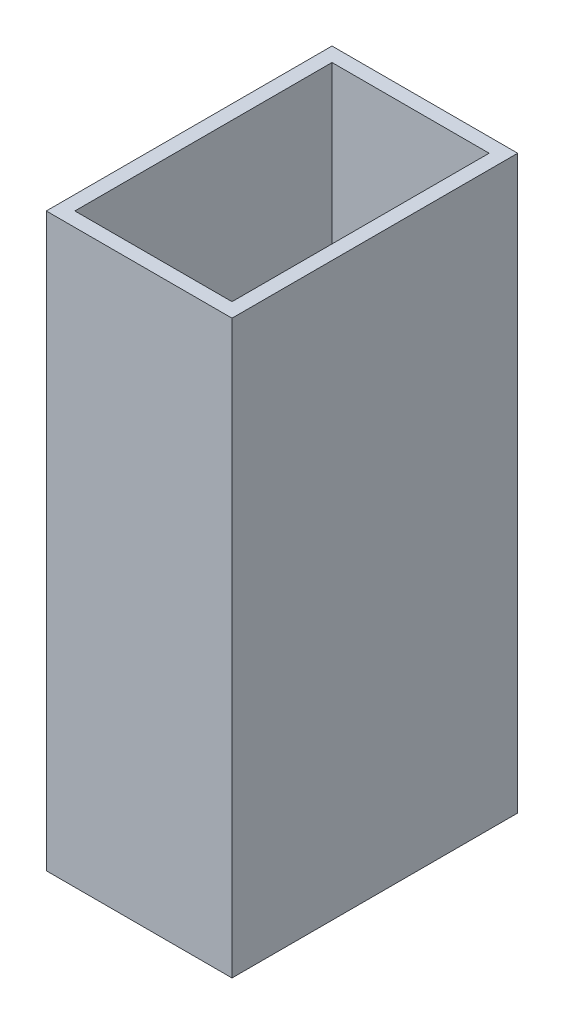
ISO-10303-21;
HEADER;
FILE_DESCRIPTION(('STEP AP214'),'2;1');
FILE_NAME('part.step','',(''),(''),'','','');
FILE_SCHEMA(('AUTOMOTIVE_DESIGN { 1 0 10303 214 1 1 1 1 }'));
ENDSEC;
DATA;
#1=APPLICATION_CONTEXT('core data for automotive mechanical design processes');
#2=APPLICATION_PROTOCOL_DEFINITION('international standard','automotive_design',2000,#1);
#3=PRODUCT_CONTEXT('',#1,'mechanical');
#4=PRODUCT('Part','Part','',(#3));
#5=PRODUCT_RELATED_PRODUCT_CATEGORY('part','',(#4));
#6=PRODUCT_DEFINITION_FORMATION('','',#4);
#7=PRODUCT_DEFINITION_CONTEXT('part definition',#1,'design');
#8=PRODUCT_DEFINITION('design','',#6,#7);
#9=PRODUCT_DEFINITION_SHAPE('','',#8);
#10=(LENGTH_UNIT() NAMED_UNIT(*) SI_UNIT(.MILLI.,.METRE.));
#11=(NAMED_UNIT(*) PLANE_ANGLE_UNIT() SI_UNIT($,.RADIAN.));
#12=(NAMED_UNIT(*) SI_UNIT($,.STERADIAN.) SOLID_ANGLE_UNIT());
#13=UNCERTAINTY_MEASURE_WITH_UNIT(LENGTH_MEASURE(1.E-05),#10,'distance_accuracy_value','');
#14=(GEOMETRIC_REPRESENTATION_CONTEXT(3) GLOBAL_UNCERTAINTY_ASSIGNED_CONTEXT((#13)) GLOBAL_UNIT_ASSIGNED_CONTEXT((#10,
#11,#12)) REPRESENTATION_CONTEXT('',''));
#15=CARTESIAN_POINT('',(0.,0.,0.));
#16=DIRECTION('',(0.,0.,1.));
#17=DIRECTION('',(1.,0.,0.));
#18=AXIS2_PLACEMENT_3D('',#15,#16,#17);
#19=CARTESIAN_POINT('',(-32.5,200.,-50.));
#20=DIRECTION('',(1.,0.,0.));
#21=DIRECTION('',(0.,0.,-1.));
#22=AXIS2_PLACEMENT_3D('',#19,#20,#21);
#23=PLANE('',#22);
#24=DIRECTION('',(0.,0.,1.));
#25=VECTOR('',#24,1.);
#26=CARTESIAN_POINT('',(-32.5,0.,-50.));
#27=LINE('',#26,#25);
#28=CARTESIAN_POINT('',(-32.5,0.,-50.));
#29=VERTEX_POINT('',#28);
#30=CARTESIAN_POINT('',(-32.5,0.,50.));
#31=VERTEX_POINT('',#30);
#32=EDGE_CURVE('E152',#29,#31,#27,.T.);
#33=ORIENTED_EDGE('',*,*,#32,.T.);
#34=DIRECTION('',(0.,-1.,0.));
#35=VECTOR('',#34,1.);
#36=CARTESIAN_POINT('',(-32.5,200.,50.));
#37=LINE('',#36,#35);
#38=CARTESIAN_POINT('',(-32.5,200.,50.));
#39=VERTEX_POINT('',#38);
#40=EDGE_CURVE('E11',#39,#31,#37,.T.);
#41=ORIENTED_EDGE('',*,*,#40,.F.);
#42=DIRECTION('',(0.,0.,1.));
#43=VECTOR('',#42,1.);
#44=CARTESIAN_POINT('',(-32.5,200.,-50.));
#45=LINE('',#44,#43);
#46=CARTESIAN_POINT('',(-32.5,200.,-50.));
#47=VERTEX_POINT('',#46);
#48=EDGE_CURVE('E145',#47,#39,#45,.T.);
#49=ORIENTED_EDGE('',*,*,#48,.F.);
#50=DIRECTION('',(0.,-1.,0.));
#51=VECTOR('',#50,1.);
#52=CARTESIAN_POINT('',(-32.5,200.,-50.));
#53=LINE('',#52,#51);
#54=EDGE_CURVE('E151',#47,#29,#53,.T.);
#55=ORIENTED_EDGE('',*,*,#54,.T.);
#56=EDGE_LOOP('',(#33,#41,#49,#55));
#57=FACE_BOUND('',#56,.T.);
#58=ADVANCED_FACE('F38',(#57),#23,.F.);
#59=CARTESIAN_POINT('',(-32.5,200.,50.));
#60=DIRECTION('',(0.,0.,-1.));
#61=DIRECTION('',(-1.,0.,0.));
#62=AXIS2_PLACEMENT_3D('',#59,#60,#61);
#63=PLANE('',#62);
#64=DIRECTION('',(1.,0.,0.));
#65=VECTOR('',#64,1.);
#66=CARTESIAN_POINT('',(-32.5,0.,50.));
#67=LINE('',#66,#65);
#68=CARTESIAN_POINT('',(32.5,0.,50.));
#69=VERTEX_POINT('',#68);
#70=EDGE_CURVE('E155',#31,#69,#67,.T.);
#71=ORIENTED_EDGE('',*,*,#70,.T.);
#72=DIRECTION('',(0.,-1.,0.));
#73=VECTOR('',#72,1.);
#74=CARTESIAN_POINT('',(32.5,200.,50.));
#75=LINE('',#74,#73);
#76=CARTESIAN_POINT('',(32.5,200.,50.));
#77=VERTEX_POINT('',#76);
#78=EDGE_CURVE('E45',#77,#69,#75,.T.);
#79=ORIENTED_EDGE('',*,*,#78,.F.);
#80=DIRECTION('',(1.,0.,0.));
#81=VECTOR('',#80,1.);
#82=CARTESIAN_POINT('',(-32.5,200.,50.));
#83=LINE('',#82,#81);
#84=EDGE_CURVE('E89',#39,#77,#83,.T.);
#85=ORIENTED_EDGE('',*,*,#84,.F.);
#86=ORIENTED_EDGE('',*,*,#40,.T.);
#87=EDGE_LOOP('',(#71,#79,#85,#86));
#88=FACE_BOUND('',#87,.T.);
#89=ADVANCED_FACE('F184',(#88),#63,.F.);
#90=CARTESIAN_POINT('',(32.5,200.,-50.));
#91=DIRECTION('',(-1.,0.,0.));
#92=DIRECTION('',(0.,0.,1.));
#93=AXIS2_PLACEMENT_3D('',#90,#91,#92);
#94=PLANE('',#93);
#95=DIRECTION('',(0.,0.,-1.));
#96=VECTOR('',#95,1.);
#97=CARTESIAN_POINT('',(32.5,0.,-50.));
#98=LINE('',#97,#96);
#99=CARTESIAN_POINT('',(32.5,0.,-50.));
#100=VERTEX_POINT('',#99);
#101=EDGE_CURVE('E157',#69,#100,#98,.T.);
#102=ORIENTED_EDGE('',*,*,#101,.T.);
#103=DIRECTION('',(0.,-1.,0.));
#104=VECTOR('',#103,1.);
#105=CARTESIAN_POINT('',(32.5,200.,-50.));
#106=LINE('',#105,#104);
#107=CARTESIAN_POINT('',(32.5,200.,-50.));
#108=VERTEX_POINT('',#107);
#109=EDGE_CURVE('E161',#108,#100,#106,.T.);
#110=ORIENTED_EDGE('',*,*,#109,.F.);
#111=DIRECTION('',(0.,0.,-1.));
#112=VECTOR('',#111,1.);
#113=CARTESIAN_POINT('',(32.5,200.,-50.));
#114=LINE('',#113,#112);
#115=EDGE_CURVE('E148',#77,#108,#114,.T.);
#116=ORIENTED_EDGE('',*,*,#115,.F.);
#117=ORIENTED_EDGE('',*,*,#78,.T.);
#118=EDGE_LOOP('',(#102,#110,#116,#117));
#119=FACE_BOUND('',#118,.T.);
#120=ADVANCED_FACE('F166',(#119),#94,.F.);
#121=CARTESIAN_POINT('',(-32.5,200.,-50.));
#122=DIRECTION('',(0.,0.,1.));
#123=DIRECTION('',(1.,0.,0.));
#124=AXIS2_PLACEMENT_3D('',#121,#122,#123);
#125=PLANE('',#124);
#126=DIRECTION('',(-1.,0.,0.));
#127=VECTOR('',#126,1.);
#128=CARTESIAN_POINT('',(-32.5,0.,-50.));
#129=LINE('',#128,#127);
#130=EDGE_CURVE('E82',#100,#29,#129,.T.);
#131=ORIENTED_EDGE('',*,*,#130,.T.);
#132=ORIENTED_EDGE('',*,*,#54,.F.);
#133=DIRECTION('',(-1.,0.,0.));
#134=VECTOR('',#133,1.);
#135=CARTESIAN_POINT('',(-32.5,200.,-50.));
#136=LINE('',#135,#134);
#137=EDGE_CURVE('E61',#108,#47,#136,.T.);
#138=ORIENTED_EDGE('',*,*,#137,.F.);
#139=ORIENTED_EDGE('',*,*,#109,.T.);
#140=EDGE_LOOP('',(#131,#132,#138,#139));
#141=FACE_BOUND('',#140,.T.);
#142=ADVANCED_FACE('F174',(#141),#125,.F.);
#143=CARTESIAN_POINT('',(0.,200.,0.));
#144=DIRECTION('',(0.,1.,0.));
#145=DIRECTION('',(0.,0.,1.));
#146=AXIS2_PLACEMENT_3D('',#143,#144,#145);
#147=PLANE('',#146);
#148=DIRECTION('',(0.,0.,1.));
#149=VECTOR('',#148,1.);
#150=CARTESIAN_POINT('',(-27.5,200.,-50.));
#151=LINE('',#150,#149);
#152=CARTESIAN_POINT('',(-27.5,200.,-45.));
#153=VERTEX_POINT('',#152);
#154=CARTESIAN_POINT('',(-27.5,200.,45.));
#155=VERTEX_POINT('',#154);
#156=EDGE_CURVE('E134',#153,#155,#151,.T.);
#157=ORIENTED_EDGE('',*,*,#156,.F.);
#158=DIRECTION('',(-1.,0.,0.));
#159=VECTOR('',#158,1.);
#160=CARTESIAN_POINT('',(-32.5,200.,-45.));
#161=LINE('',#160,#159);
#162=CARTESIAN_POINT('',(27.5,200.,-45.));
#163=VERTEX_POINT('',#162);
#164=EDGE_CURVE('E143',#163,#153,#161,.T.);
#165=ORIENTED_EDGE('',*,*,#164,.F.);
#166=DIRECTION('',(0.,0.,-1.));
#167=VECTOR('',#166,1.);
#168=CARTESIAN_POINT('',(27.5,200.,-50.));
#169=LINE('',#168,#167);
#170=CARTESIAN_POINT('',(27.5,200.,45.));
#171=VERTEX_POINT('',#170);
#172=EDGE_CURVE('E141',#171,#163,#169,.T.);
#173=ORIENTED_EDGE('',*,*,#172,.F.);
#174=DIRECTION('',(1.,0.,0.));
#175=VECTOR('',#174,1.);
#176=CARTESIAN_POINT('',(-32.5,200.,45.));
#177=LINE('',#176,#175);
#178=EDGE_CURVE('E126',#155,#171,#177,.T.);
#179=ORIENTED_EDGE('',*,*,#178,.F.);
#180=EDGE_LOOP('',(#157,#165,#173,#179));
#181=FACE_BOUND('',#180,.T.);
#182=ORIENTED_EDGE('',*,*,#48,.T.);
#183=ORIENTED_EDGE('',*,*,#84,.T.);
#184=ORIENTED_EDGE('',*,*,#115,.T.);
#185=ORIENTED_EDGE('',*,*,#137,.T.);
#186=EDGE_LOOP('',(#182,#183,#184,#185));
#187=FACE_BOUND('',#186,.T.);
#188=ADVANCED_FACE('F176',(#181,#187),#147,.T.);
#189=CARTESIAN_POINT('',(0.,0.,0.));
#190=DIRECTION('',(0.,1.,0.));
#191=DIRECTION('',(0.,0.,1.));
#192=AXIS2_PLACEMENT_3D('',#189,#190,#191);
#193=PLANE('',#192);
#194=ORIENTED_EDGE('',*,*,#32,.F.);
#195=ORIENTED_EDGE('',*,*,#130,.F.);
#196=ORIENTED_EDGE('',*,*,#101,.F.);
#197=ORIENTED_EDGE('',*,*,#70,.F.);
#198=EDGE_LOOP('',(#194,#195,#196,#197));
#199=FACE_BOUND('',#198,.T.);
#200=ADVANCED_FACE('F170',(#199),#193,.F.);
#201=CARTESIAN_POINT('',(-27.5,200.,-50.));
#202=DIRECTION('',(1.,0.,0.));
#203=DIRECTION('',(0.,0.,-1.));
#204=AXIS2_PLACEMENT_3D('',#201,#202,#203);
#205=PLANE('',#204);
#206=DIRECTION('',(0.,0.,1.));
#207=VECTOR('',#206,1.);
#208=CARTESIAN_POINT('',(-27.5,5.,-50.));
#209=LINE('',#208,#207);
#210=CARTESIAN_POINT('',(-27.5,5.,-45.));
#211=VERTEX_POINT('',#210);
#212=CARTESIAN_POINT('',(-27.5,5.,45.));
#213=VERTEX_POINT('',#212);
#214=EDGE_CURVE('E117',#211,#213,#209,.T.);
#215=ORIENTED_EDGE('',*,*,#214,.F.);
#216=DIRECTION('',(0.,-1.,0.));
#217=VECTOR('',#216,1.);
#218=CARTESIAN_POINT('',(-27.5,200.,-45.));
#219=LINE('',#218,#217);
#220=EDGE_CURVE('E137',#153,#211,#219,.T.);
#221=ORIENTED_EDGE('',*,*,#220,.F.);
#222=ORIENTED_EDGE('',*,*,#156,.T.);
#223=DIRECTION('',(0.,-1.,0.));
#224=VECTOR('',#223,1.);
#225=CARTESIAN_POINT('',(-27.5,200.,45.));
#226=LINE('',#225,#224);
#227=EDGE_CURVE('E129',#155,#213,#226,.T.);
#228=ORIENTED_EDGE('',*,*,#227,.T.);
#229=EDGE_LOOP('',(#215,#221,#222,#228));
#230=FACE_BOUND('',#229,.T.);
#231=ADVANCED_FACE('F211',(#230),#205,.T.);
#232=CARTESIAN_POINT('',(-32.5,200.,45.));
#233=DIRECTION('',(0.,0.,-1.));
#234=DIRECTION('',(-1.,0.,0.));
#235=AXIS2_PLACEMENT_3D('',#232,#233,#234);
#236=PLANE('',#235);
#237=DIRECTION('',(1.,0.,0.));
#238=VECTOR('',#237,1.);
#239=CARTESIAN_POINT('',(-32.5,5.,45.));
#240=LINE('',#239,#238);
#241=CARTESIAN_POINT('',(27.5,5.,45.));
#242=VERTEX_POINT('',#241);
#243=EDGE_CURVE('E111',#213,#242,#240,.T.);
#244=ORIENTED_EDGE('',*,*,#243,.F.);
#245=ORIENTED_EDGE('',*,*,#227,.F.);
#246=ORIENTED_EDGE('',*,*,#178,.T.);
#247=DIRECTION('',(0.,-1.,0.));
#248=VECTOR('',#247,1.);
#249=CARTESIAN_POINT('',(27.5,200.,45.));
#250=LINE('',#249,#248);
#251=EDGE_CURVE('E123',#171,#242,#250,.T.);
#252=ORIENTED_EDGE('',*,*,#251,.T.);
#253=EDGE_LOOP('',(#244,#245,#246,#252));
#254=FACE_BOUND('',#253,.T.);
#255=ADVANCED_FACE('F124',(#254),#236,.T.);
#256=CARTESIAN_POINT('',(27.5,200.,-50.));
#257=DIRECTION('',(-1.,0.,0.));
#258=DIRECTION('',(0.,0.,1.));
#259=AXIS2_PLACEMENT_3D('',#256,#257,#258);
#260=PLANE('',#259);
#261=DIRECTION('',(0.,0.,-1.));
#262=VECTOR('',#261,1.);
#263=CARTESIAN_POINT('',(27.5,5.,-50.));
#264=LINE('',#263,#262);
#265=CARTESIAN_POINT('',(27.5,5.,-45.));
#266=VERTEX_POINT('',#265);
#267=EDGE_CURVE('E115',#242,#266,#264,.T.);
#268=ORIENTED_EDGE('',*,*,#267,.F.);
#269=ORIENTED_EDGE('',*,*,#251,.F.);
#270=ORIENTED_EDGE('',*,*,#172,.T.);
#271=DIRECTION('',(0.,-1.,0.));
#272=VECTOR('',#271,1.);
#273=CARTESIAN_POINT('',(27.5,200.,-45.));
#274=LINE('',#273,#272);
#275=EDGE_CURVE('E52',#163,#266,#274,.T.);
#276=ORIENTED_EDGE('',*,*,#275,.T.);
#277=EDGE_LOOP('',(#268,#269,#270,#276));
#278=FACE_BOUND('',#277,.T.);
#279=ADVANCED_FACE('F131',(#278),#260,.T.);
#280=CARTESIAN_POINT('',(-32.5,200.,-45.));
#281=DIRECTION('',(0.,0.,1.));
#282=DIRECTION('',(1.,0.,0.));
#283=AXIS2_PLACEMENT_3D('',#280,#281,#282);
#284=PLANE('',#283);
#285=DIRECTION('',(-1.,0.,0.));
#286=VECTOR('',#285,1.);
#287=CARTESIAN_POINT('',(-32.5,5.,-45.));
#288=LINE('',#287,#286);
#289=EDGE_CURVE('E132',#266,#211,#288,.T.);
#290=ORIENTED_EDGE('',*,*,#289,.F.);
#291=ORIENTED_EDGE('',*,*,#275,.F.);
#292=ORIENTED_EDGE('',*,*,#164,.T.);
#293=ORIENTED_EDGE('',*,*,#220,.T.);
#294=EDGE_LOOP('',(#290,#291,#292,#293));
#295=FACE_BOUND('',#294,.T.);
#296=ADVANCED_FACE('F241',(#295),#284,.T.);
#297=CARTESIAN_POINT('',(0.,5.,0.));
#298=DIRECTION('',(0.,1.,0.));
#299=DIRECTION('',(0.,0.,1.));
#300=AXIS2_PLACEMENT_3D('',#297,#298,#299);
#301=PLANE('',#300);
#302=ORIENTED_EDGE('',*,*,#214,.T.);
#303=ORIENTED_EDGE('',*,*,#243,.T.);
#304=ORIENTED_EDGE('',*,*,#267,.T.);
#305=ORIENTED_EDGE('',*,*,#289,.T.);
#306=EDGE_LOOP('',(#302,#303,#304,#305));
#307=FACE_BOUND('',#306,.T.);
#308=ADVANCED_FACE('F113',(#307),#301,.T.);
#309=CLOSED_SHELL('',(#58,#89,#120,#142,#188,#200,#231,#255,#279,#296,#308));
#310=MANIFOLD_SOLID_BREP('B2',#309);
#311=ADVANCED_BREP_SHAPE_REPRESENTATION('',(#18,#310),#14);
#312=SHAPE_DEFINITION_REPRESENTATION(#9,#311);
ENDSEC;
END-ISO-10303-21;
